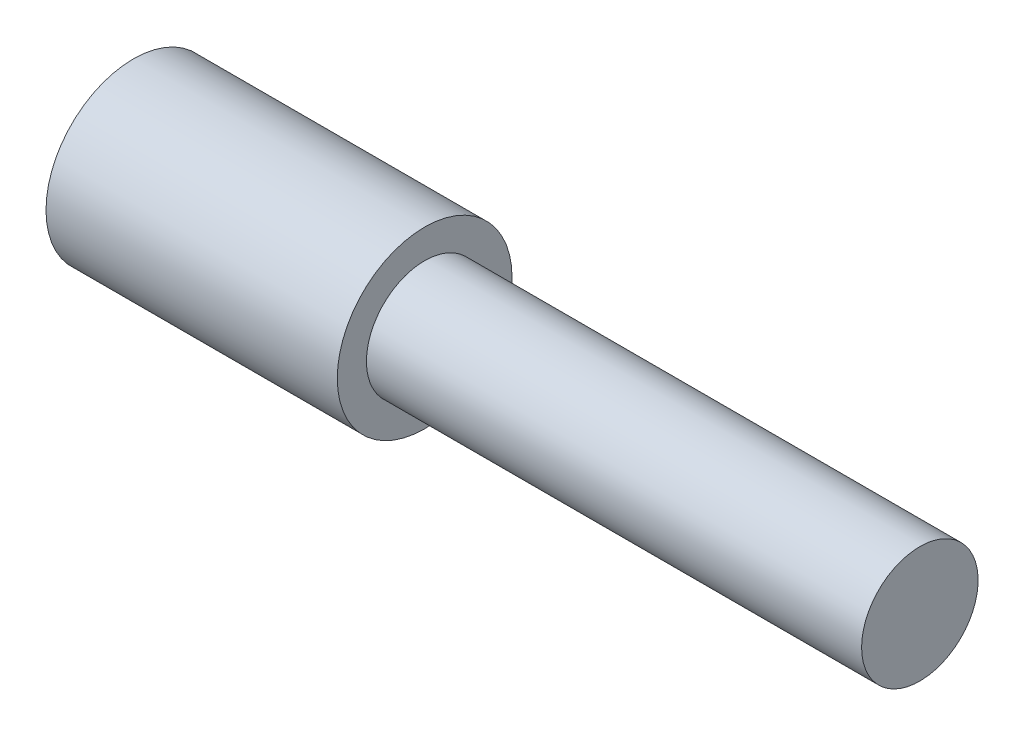
ISO-10303-21;
HEADER;
FILE_DESCRIPTION(('STEP AP214'),'2;1');
FILE_NAME('part.step','',(''),(''),'','','');
FILE_SCHEMA(('AUTOMOTIVE_DESIGN { 1 0 10303 214 1 1 1 1 }'));
ENDSEC;
DATA;
#1=APPLICATION_CONTEXT('core data for automotive mechanical design processes');
#2=APPLICATION_PROTOCOL_DEFINITION('international standard','automotive_design',2000,#1);
#3=PRODUCT_CONTEXT('',#1,'mechanical');
#4=PRODUCT('Part','Part','',(#3));
#5=PRODUCT_RELATED_PRODUCT_CATEGORY('part','',(#4));
#6=PRODUCT_DEFINITION_FORMATION('','',#4);
#7=PRODUCT_DEFINITION_CONTEXT('part definition',#1,'design');
#8=PRODUCT_DEFINITION('design','',#6,#7);
#9=PRODUCT_DEFINITION_SHAPE('','',#8);
#10=(LENGTH_UNIT() NAMED_UNIT(*) SI_UNIT(.MILLI.,.METRE.));
#11=(NAMED_UNIT(*) PLANE_ANGLE_UNIT() SI_UNIT($,.RADIAN.));
#12=(NAMED_UNIT(*) SI_UNIT($,.STERADIAN.) SOLID_ANGLE_UNIT());
#13=UNCERTAINTY_MEASURE_WITH_UNIT(LENGTH_MEASURE(1.E-05),#10,'distance_accuracy_value','');
#14=(GEOMETRIC_REPRESENTATION_CONTEXT(3) GLOBAL_UNCERTAINTY_ASSIGNED_CONTEXT((#13)) GLOBAL_UNIT_ASSIGNED_CONTEXT((#10,
#11,#12)) REPRESENTATION_CONTEXT('',''));
#15=CARTESIAN_POINT('',(0.,0.,0.));
#16=DIRECTION('',(0.,0.,1.));
#17=DIRECTION('',(1.,0.,0.));
#18=AXIS2_PLACEMENT_3D('',#15,#16,#17);
#19=CARTESIAN_POINT('',(27.,0.,0.));
#20=DIRECTION('',(-1.,0.,0.));
#21=DIRECTION('',(0.,0.,1.));
#22=AXIS2_PLACEMENT_3D('',#19,#20,#21);
#23=PLANE('',#22);
#24=CARTESIAN_POINT('',(27.,0.,0.));
#25=DIRECTION('',(-1.,0.,0.));
#26=DIRECTION('',(0.,0.,1.));
#27=AXIS2_PLACEMENT_3D('',#24,#25,#26);
#28=CIRCLE('',#27,2.);
#29=CARTESIAN_POINT('',(27.,0.,2.));
#30=VERTEX_POINT('',#29);
#31=EDGE_CURVE('E10',#30,#30,#28,.T.);
#32=ORIENTED_EDGE('',*,*,#31,.F.);
#33=EDGE_LOOP('',(#32));
#34=FACE_BOUND('',#33,.T.);
#35=ADVANCED_FACE('F30',(#34),#23,.F.);
#36=CARTESIAN_POINT('',(0.,0.,0.));
#37=DIRECTION('',(-1.,0.,0.));
#38=DIRECTION('',(0.,0.,1.));
#39=AXIS2_PLACEMENT_3D('',#36,#37,#38);
#40=CYLINDRICAL_SURFACE('',#39,2.);
#41=CARTESIAN_POINT('',(10.,0.,0.));
#42=DIRECTION('',(-1.,0.,0.));
#43=DIRECTION('',(0.,0.,1.));
#44=AXIS2_PLACEMENT_3D('',#41,#42,#43);
#45=CIRCLE('',#44,2.);
#46=CARTESIAN_POINT('',(10.,0.,2.));
#47=VERTEX_POINT('',#46);
#48=EDGE_CURVE('E36',#47,#47,#45,.T.);
#49=ORIENTED_EDGE('',*,*,#48,.F.);
#50=EDGE_LOOP('',(#49));
#51=FACE_BOUND('',#50,.T.);
#52=ORIENTED_EDGE('',*,*,#31,.T.);
#53=EDGE_LOOP('',(#52));
#54=FACE_BOUND('',#53,.T.);
#55=ADVANCED_FACE('F60',(#51,#54),#40,.T.);
#56=CARTESIAN_POINT('',(10.,2.,0.));
#57=DIRECTION('',(-1.,0.,0.));
#58=DIRECTION('',(0.,0.,1.));
#59=AXIS2_PLACEMENT_3D('',#56,#57,#58);
#60=PLANE('',#59);
#61=CARTESIAN_POINT('',(10.,0.,0.));
#62=DIRECTION('',(-1.,0.,0.));
#63=DIRECTION('',(0.,0.,1.));
#64=AXIS2_PLACEMENT_3D('',#61,#62,#63);
#65=CIRCLE('',#64,3.);
#66=CARTESIAN_POINT('',(10.,0.,3.));
#67=VERTEX_POINT('',#66);
#68=EDGE_CURVE('E40',#67,#67,#65,.T.);
#69=ORIENTED_EDGE('',*,*,#68,.F.);
#70=EDGE_LOOP('',(#69));
#71=FACE_BOUND('',#70,.T.);
#72=ORIENTED_EDGE('',*,*,#48,.T.);
#73=EDGE_LOOP('',(#72));
#74=FACE_BOUND('',#73,.T.);
#75=ADVANCED_FACE('F55',(#71,#74),#60,.F.);
#76=CARTESIAN_POINT('',(0.,0.,0.));
#77=DIRECTION('',(-1.,0.,0.));
#78=DIRECTION('',(0.,0.,1.));
#79=AXIS2_PLACEMENT_3D('',#76,#77,#78);
#80=CYLINDRICAL_SURFACE('',#79,3.);
#81=CARTESIAN_POINT('',(0.,0.,0.));
#82=DIRECTION('',(-1.,0.,0.));
#83=DIRECTION('',(0.,0.,1.));
#84=AXIS2_PLACEMENT_3D('',#81,#82,#83);
#85=CIRCLE('',#84,3.);
#86=CARTESIAN_POINT('',(0.,0.,3.));
#87=VERTEX_POINT('',#86);
#88=EDGE_CURVE('E44',#87,#87,#85,.T.);
#89=ORIENTED_EDGE('',*,*,#88,.F.);
#90=EDGE_LOOP('',(#89));
#91=FACE_BOUND('',#90,.T.);
#92=ORIENTED_EDGE('',*,*,#68,.T.);
#93=EDGE_LOOP('',(#92));
#94=FACE_BOUND('',#93,.T.);
#95=ADVANCED_FACE('F52',(#91,#94),#80,.T.);
#96=CARTESIAN_POINT('',(0.,3.,0.));
#97=DIRECTION('',(1.,0.,0.));
#98=DIRECTION('',(0.,0.,-1.));
#99=AXIS2_PLACEMENT_3D('',#96,#97,#98);
#100=PLANE('',#99);
#101=ORIENTED_EDGE('',*,*,#88,.T.);
#102=EDGE_LOOP('',(#101));
#103=FACE_BOUND('',#102,.T.);
#104=ADVANCED_FACE('F50',(#103),#100,.F.);
#105=CLOSED_SHELL('',(#35,#55,#75,#95,#104));
#106=MANIFOLD_SOLID_BREP('B2',#105);
#107=ADVANCED_BREP_SHAPE_REPRESENTATION('',(#18,#106),#14);
#108=SHAPE_DEFINITION_REPRESENTATION(#9,#107);
ENDSEC;
END-ISO-10303-21;
